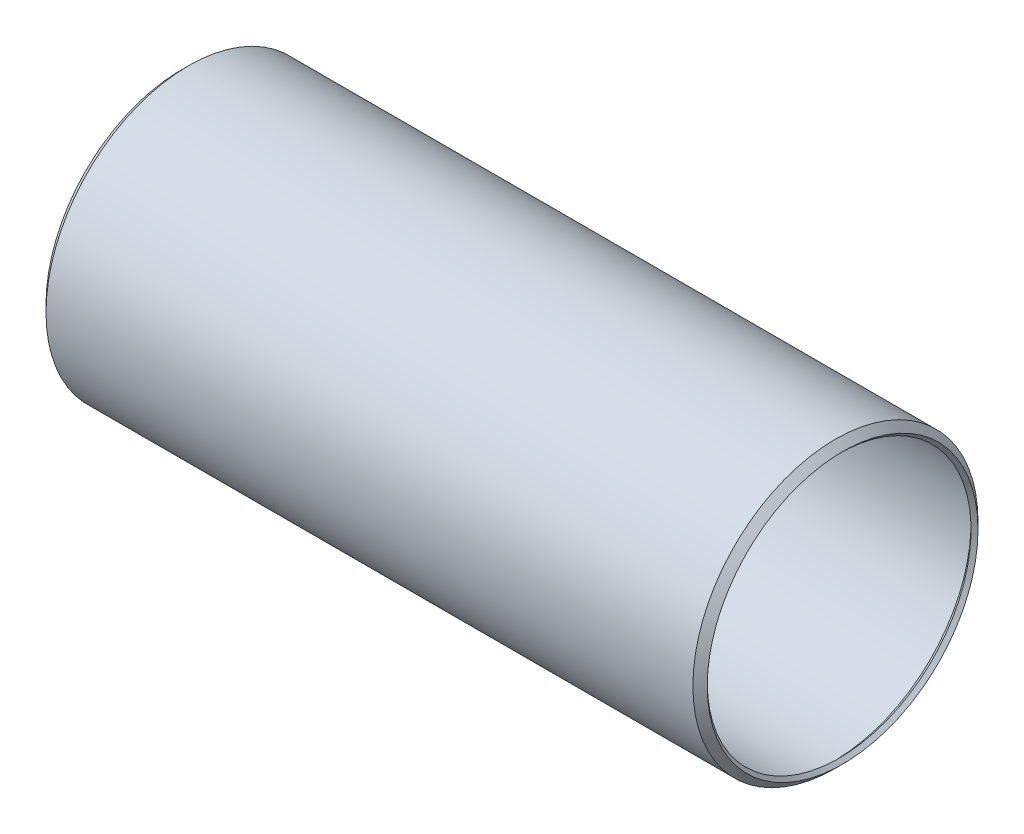
ISO-10303-21;
HEADER;
FILE_DESCRIPTION(('STEP AP214'),'2;1');
FILE_NAME('part.step','',(''),(''),'','','');
FILE_SCHEMA(('AUTOMOTIVE_DESIGN { 1 0 10303 214 1 1 1 1 }'));
ENDSEC;
DATA;
#1=APPLICATION_CONTEXT('core data for automotive mechanical design processes');
#2=APPLICATION_PROTOCOL_DEFINITION('international standard','automotive_design',2000,#1);
#3=PRODUCT_CONTEXT('',#1,'mechanical');
#4=PRODUCT('Part','Part','',(#3));
#5=PRODUCT_RELATED_PRODUCT_CATEGORY('part','',(#4));
#6=PRODUCT_DEFINITION_FORMATION('','',#4);
#7=PRODUCT_DEFINITION_CONTEXT('part definition',#1,'design');
#8=PRODUCT_DEFINITION('design','',#6,#7);
#9=PRODUCT_DEFINITION_SHAPE('','',#8);
#10=(LENGTH_UNIT() NAMED_UNIT(*) SI_UNIT(.MILLI.,.METRE.));
#11=(NAMED_UNIT(*) PLANE_ANGLE_UNIT() SI_UNIT($,.RADIAN.));
#12=(NAMED_UNIT(*) SI_UNIT($,.STERADIAN.) SOLID_ANGLE_UNIT());
#13=UNCERTAINTY_MEASURE_WITH_UNIT(LENGTH_MEASURE(1.E-05),#10,'distance_accuracy_value','');
#14=(GEOMETRIC_REPRESENTATION_CONTEXT(3) GLOBAL_UNCERTAINTY_ASSIGNED_CONTEXT((#13)) GLOBAL_UNIT_ASSIGNED_CONTEXT((#10,
#11,#12)) REPRESENTATION_CONTEXT('',''));
#15=CARTESIAN_POINT('',(0.,0.,0.));
#16=DIRECTION('',(0.,0.,1.));
#17=DIRECTION('',(1.,0.,0.));
#18=AXIS2_PLACEMENT_3D('',#15,#16,#17);
#19=CARTESIAN_POINT('',(-112.443556881433,0.,0.));
#20=DIRECTION('',(1.,0.,0.));
#21=DIRECTION('',(0.,0.,-1.));
#22=AXIS2_PLACEMENT_3D('',#19,#20,#21);
#23=CONICAL_SURFACE('',#22,26.4922000000035,0.785398163397447);
#24=CARTESIAN_POINT('',(-113.77817844072,0.,0.));
#25=DIRECTION('',(-1.,0.,0.));
#26=DIRECTION('',(0.,0.,1.));
#27=AXIS2_PLACEMENT_3D('',#24,#25,#26);
#28=CIRCLE('',#27,25.157578440717);
#29=CARTESIAN_POINT('',(-113.77817844072,0.,25.157578440717));
#30=VERTEX_POINT('',#29);
#31=EDGE_CURVE('E10',#30,#30,#28,.T.);
#32=ORIENTED_EDGE('',*,*,#31,.F.);
#33=EDGE_LOOP('',(#32));
#34=FACE_BOUND('',#33,.T.);
#35=CARTESIAN_POINT('',(-112.443556881433,0.,0.));
#36=DIRECTION('',(-1.,0.,0.));
#37=DIRECTION('',(0.,0.,1.));
#38=AXIS2_PLACEMENT_3D('',#35,#36,#37);
#39=CIRCLE('',#38,26.4922000000035);
#40=CARTESIAN_POINT('',(-112.443556881433,0.,26.4922000000035));
#41=VERTEX_POINT('',#40);
#42=EDGE_CURVE('E59',#41,#41,#39,.T.);
#43=ORIENTED_EDGE('',*,*,#42,.T.);
#44=EDGE_LOOP('',(#43));
#45=FACE_BOUND('',#44,.T.);
#46=ADVANCED_FACE('F31',(#34,#45),#23,.T.);
#47=CARTESIAN_POINT('',(-113.77817844072,0.,0.));
#48=DIRECTION('',(-1.,0.,0.));
#49=DIRECTION('',(0.,0.,1.));
#50=AXIS2_PLACEMENT_3D('',#47,#48,#49);
#51=CONICAL_SURFACE('',#50,25.157578440717,0.785398163397446);
#52=CARTESIAN_POINT('',(-113.131600000001,0.,0.));
#53=DIRECTION('',(-1.,0.,0.));
#54=DIRECTION('',(0.,0.,1.));
#55=AXIS2_PLACEMENT_3D('',#52,#53,#54);
#56=CIRCLE('',#55,24.5109999999985);
#57=CARTESIAN_POINT('',(-113.131600000001,0.,24.5109999999985));
#58=VERTEX_POINT('',#57);
#59=EDGE_CURVE('E37',#58,#58,#56,.T.);
#60=ORIENTED_EDGE('',*,*,#59,.F.);
#61=EDGE_LOOP('',(#60));
#62=FACE_BOUND('',#61,.T.);
#63=ORIENTED_EDGE('',*,*,#31,.T.);
#64=EDGE_LOOP('',(#63));
#65=FACE_BOUND('',#64,.T.);
#66=ADVANCED_FACE('F96',(#62,#65),#51,.F.);
#67=CARTESIAN_POINT('',(-113.131600000001,0.,0.));
#68=DIRECTION('',(1.,0.,0.));
#69=DIRECTION('',(0.,0.,-1.));
#70=AXIS2_PLACEMENT_3D('',#67,#68,#69);
#71=CONICAL_SURFACE('',#70,24.5109999999985,0.785398163397455);
#72=CARTESIAN_POINT('',(-112.064800000002,0.,0.));
#73=DIRECTION('',(-1.,0.,0.));
#74=DIRECTION('',(0.,0.,1.));
#75=AXIS2_PLACEMENT_3D('',#72,#73,#74);
#76=CIRCLE('',#75,25.5777999999985);
#77=CARTESIAN_POINT('',(-112.064800000002,0.,25.5777999999985));
#78=VERTEX_POINT('',#77);
#79=EDGE_CURVE('E41',#78,#78,#76,.T.);
#80=ORIENTED_EDGE('',*,*,#79,.F.);
#81=EDGE_LOOP('',(#80));
#82=FACE_BOUND('',#81,.T.);
#83=ORIENTED_EDGE('',*,*,#59,.T.);
#84=EDGE_LOOP('',(#83));
#85=FACE_BOUND('',#84,.T.);
#86=ADVANCED_FACE('F91',(#82,#85),#71,.F.);
#87=CARTESIAN_POINT('',(7.3914,0.,0.));
#88=DIRECTION('',(-1.,0.,0.));
#89=DIRECTION('',(0.,0.,1.));
#90=AXIS2_PLACEMENT_3D('',#87,#88,#89);
#91=CYLINDRICAL_SURFACE('',#90,25.5777999999985);
#92=CARTESIAN_POINT('',(7.39139999999851,0.,0.));
#93=DIRECTION('',(-1.,0.,0.));
#94=DIRECTION('',(0.,0.,1.));
#95=AXIS2_PLACEMENT_3D('',#92,#93,#94);
#96=CIRCLE('',#95,25.5777999999985);
#97=CARTESIAN_POINT('',(7.39139999999851,0.,25.5777999999985));
#98=VERTEX_POINT('',#97);
#99=EDGE_CURVE('E45',#98,#98,#96,.T.);
#100=ORIENTED_EDGE('',*,*,#99,.F.);
#101=EDGE_LOOP('',(#100));
#102=FACE_BOUND('',#101,.T.);
#103=ORIENTED_EDGE('',*,*,#79,.T.);
#104=EDGE_LOOP('',(#103));
#105=FACE_BOUND('',#104,.T.);
#106=ADVANCED_FACE('F85',(#102,#105),#91,.F.);
#107=CARTESIAN_POINT('',(7.39139999999851,0.,0.));
#108=DIRECTION('',(-1.,0.,0.));
#109=DIRECTION('',(0.,0.,1.));
#110=AXIS2_PLACEMENT_3D('',#107,#108,#109);
#111=CONICAL_SURFACE('',#110,25.5777999999985,0.785398163397448);
#112=CARTESIAN_POINT('',(8.45819999999851,0.,0.));
#113=DIRECTION('',(-1.,0.,0.));
#114=DIRECTION('',(0.,0.,1.));
#115=AXIS2_PLACEMENT_3D('',#112,#113,#114);
#116=CIRCLE('',#115,24.5109999999985);
#117=CARTESIAN_POINT('',(8.45819999999851,0.,24.5109999999985));
#118=VERTEX_POINT('',#117);
#119=EDGE_CURVE('E50',#118,#118,#116,.T.);
#120=ORIENTED_EDGE('',*,*,#119,.F.);
#121=EDGE_LOOP('',(#120));
#122=FACE_BOUND('',#121,.T.);
#123=ORIENTED_EDGE('',*,*,#99,.T.);
#124=EDGE_LOOP('',(#123));
#125=FACE_BOUND('',#124,.T.);
#126=ADVANCED_FACE('F79',(#122,#125),#111,.F.);
#127=CARTESIAN_POINT('',(8.45819999999851,0.,0.));
#128=DIRECTION('',(1.,0.,0.));
#129=DIRECTION('',(0.,0.,-1.));
#130=AXIS2_PLACEMENT_3D('',#127,#128,#129);
#131=CONICAL_SURFACE('',#130,24.5109999999985,0.785398163397446);
#132=CARTESIAN_POINT('',(9.104778440717,0.,0.));
#133=DIRECTION('',(-1.,0.,0.));
#134=DIRECTION('',(0.,0.,1.));
#135=AXIS2_PLACEMENT_3D('',#132,#133,#134);
#136=CIRCLE('',#135,25.157578440717);
#137=CARTESIAN_POINT('',(9.104778440717,0.,25.157578440717));
#138=VERTEX_POINT('',#137);
#139=EDGE_CURVE('E53',#138,#138,#136,.T.);
#140=ORIENTED_EDGE('',*,*,#139,.F.);
#141=EDGE_LOOP('',(#140));
#142=FACE_BOUND('',#141,.T.);
#143=ORIENTED_EDGE('',*,*,#119,.T.);
#144=EDGE_LOOP('',(#143));
#145=FACE_BOUND('',#144,.T.);
#146=ADVANCED_FACE('F73',(#142,#145),#131,.F.);
#147=CARTESIAN_POINT('',(9.104778440717,0.,0.));
#148=DIRECTION('',(-1.,0.,0.));
#149=DIRECTION('',(0.,0.,1.));
#150=AXIS2_PLACEMENT_3D('',#147,#148,#149);
#151=CONICAL_SURFACE('',#150,25.157578440717,0.78539816339741);
#152=CARTESIAN_POINT('',(7.7701568814304,0.,0.));
#153=DIRECTION('',(-1.,0.,0.));
#154=DIRECTION('',(0.,0.,1.));
#155=AXIS2_PLACEMENT_3D('',#152,#153,#154);
#156=CIRCLE('',#155,26.4922000000035);
#157=CARTESIAN_POINT('',(7.7701568814304,0.,26.4922000000035));
#158=VERTEX_POINT('',#157);
#159=EDGE_CURVE('E56',#158,#158,#156,.T.);
#160=ORIENTED_EDGE('',*,*,#159,.F.);
#161=EDGE_LOOP('',(#160));
#162=FACE_BOUND('',#161,.T.);
#163=ORIENTED_EDGE('',*,*,#139,.T.);
#164=EDGE_LOOP('',(#163));
#165=FACE_BOUND('',#164,.T.);
#166=ADVANCED_FACE('F67',(#162,#165),#151,.T.);
#167=CARTESIAN_POINT('',(7.3914,0.,0.));
#168=DIRECTION('',(-1.,0.,0.));
#169=DIRECTION('',(0.,0.,1.));
#170=AXIS2_PLACEMENT_3D('',#167,#168,#169);
#171=CYLINDRICAL_SURFACE('',#170,26.4922000000035);
#172=ORIENTED_EDGE('',*,*,#42,.F.);
#173=EDGE_LOOP('',(#172));
#174=FACE_BOUND('',#173,.T.);
#175=ORIENTED_EDGE('',*,*,#159,.T.);
#176=EDGE_LOOP('',(#175));
#177=FACE_BOUND('',#176,.T.);
#178=ADVANCED_FACE('F64',(#174,#177),#171,.T.);
#179=CLOSED_SHELL('',(#46,#66,#86,#106,#126,#146,#166,#178));
#180=MANIFOLD_SOLID_BREP('B2',#179);
#181=ADVANCED_BREP_SHAPE_REPRESENTATION('',(#18,#180),#14);
#182=SHAPE_DEFINITION_REPRESENTATION(#9,#181);
ENDSEC;
END-ISO-10303-21;
